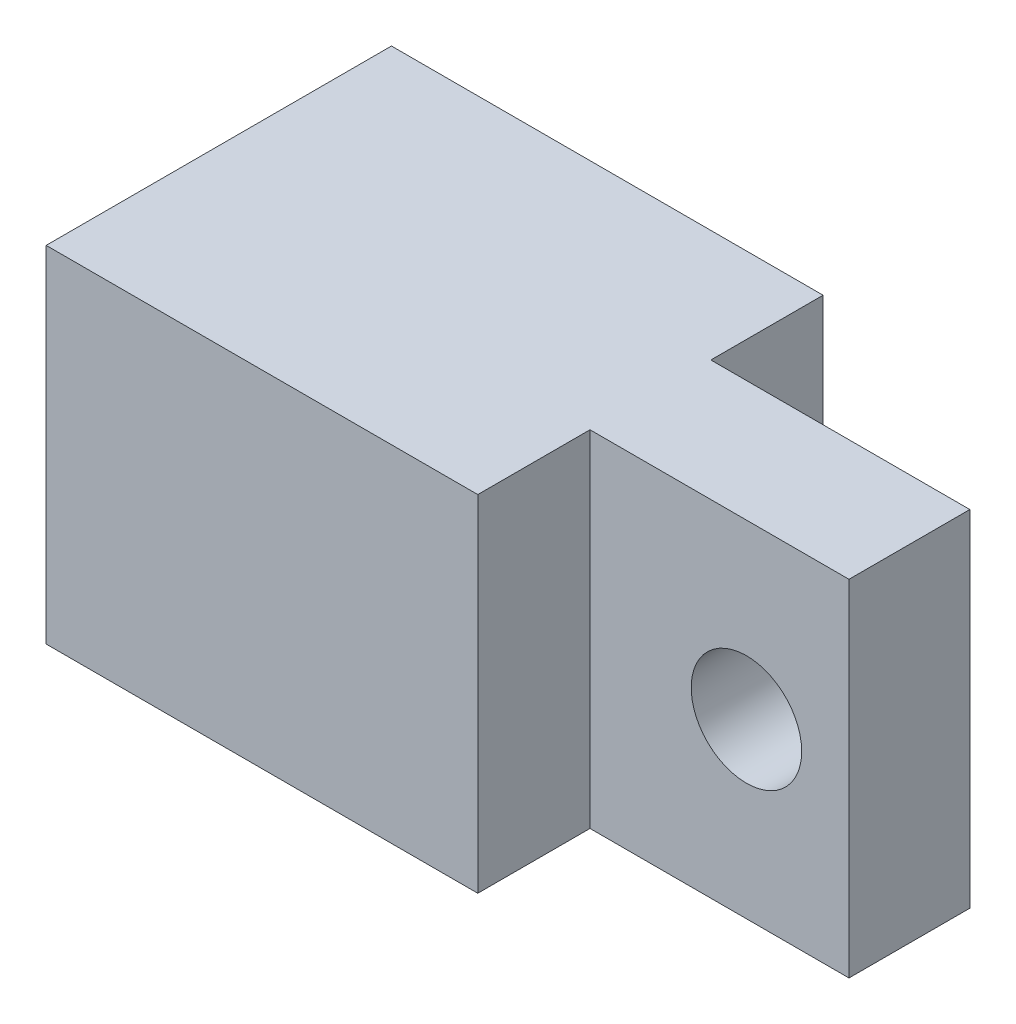
ISO-10303-21;
HEADER;
FILE_DESCRIPTION(('STEP AP214'),'2;1');
FILE_NAME('part.step','',(''),(''),'','','');
FILE_SCHEMA(('AUTOMOTIVE_DESIGN { 1 0 10303 214 1 1 1 1 }'));
ENDSEC;
DATA;
#1=APPLICATION_CONTEXT('core data for automotive mechanical design processes');
#2=APPLICATION_PROTOCOL_DEFINITION('international standard','automotive_design',2000,#1);
#3=PRODUCT_CONTEXT('',#1,'mechanical');
#4=PRODUCT('Part','Part','',(#3));
#5=PRODUCT_RELATED_PRODUCT_CATEGORY('part','',(#4));
#6=PRODUCT_DEFINITION_FORMATION('','',#4);
#7=PRODUCT_DEFINITION_CONTEXT('part definition',#1,'design');
#8=PRODUCT_DEFINITION('design','',#6,#7);
#9=PRODUCT_DEFINITION_SHAPE('','',#8);
#10=(LENGTH_UNIT() NAMED_UNIT(*) SI_UNIT(.MILLI.,.METRE.));
#11=(NAMED_UNIT(*) PLANE_ANGLE_UNIT() SI_UNIT($,.RADIAN.));
#12=(NAMED_UNIT(*) SI_UNIT($,.STERADIAN.) SOLID_ANGLE_UNIT());
#13=UNCERTAINTY_MEASURE_WITH_UNIT(LENGTH_MEASURE(1.E-05),#10,'distance_accuracy_value','');
#14=(GEOMETRIC_REPRESENTATION_CONTEXT(3) GLOBAL_UNCERTAINTY_ASSIGNED_CONTEXT((#13)) GLOBAL_UNIT_ASSIGNED_CONTEXT((#10,
#11,#12)) REPRESENTATION_CONTEXT('',''));
#15=CARTESIAN_POINT('',(0.,0.,0.));
#16=DIRECTION('',(0.,0.,1.));
#17=DIRECTION('',(1.,0.,0.));
#18=AXIS2_PLACEMENT_3D('',#15,#16,#17);
#19=CARTESIAN_POINT('',(6.25,10.,0.));
#20=DIRECTION('',(1.,0.,0.));
#21=DIRECTION('',(0.,0.,-1.));
#22=AXIS2_PLACEMENT_3D('',#19,#20,#21);
#23=PLANE('',#22);
#24=DIRECTION('',(0.,0.,1.));
#25=VECTOR('',#24,1.);
#26=CARTESIAN_POINT('',(6.25,0.,0.));
#27=LINE('',#26,#25);
#28=CARTESIAN_POINT('',(6.25,0.,1.75));
#29=VERTEX_POINT('',#28);
#30=CARTESIAN_POINT('',(6.25,0.,5.));
#31=VERTEX_POINT('',#30);
#32=EDGE_CURVE('E132',#29,#31,#27,.T.);
#33=ORIENTED_EDGE('',*,*,#32,.F.);
#34=DIRECTION('',(0.,-1.,0.));
#35=VECTOR('',#34,1.);
#36=CARTESIAN_POINT('',(6.25,10.,1.75));
#37=LINE('',#36,#35);
#38=CARTESIAN_POINT('',(6.25,10.,1.75));
#39=VERTEX_POINT('',#38);
#40=EDGE_CURVE('E11',#39,#29,#37,.T.);
#41=ORIENTED_EDGE('',*,*,#40,.F.);
#42=DIRECTION('',(0.,0.,1.));
#43=VECTOR('',#42,1.);
#44=CARTESIAN_POINT('',(6.25,10.,0.));
#45=LINE('',#44,#43);
#46=CARTESIAN_POINT('',(6.25,10.,5.));
#47=VERTEX_POINT('',#46);
#48=EDGE_CURVE('E151',#39,#47,#45,.T.);
#49=ORIENTED_EDGE('',*,*,#48,.T.);
#50=DIRECTION('',(0.,-1.,0.));
#51=VECTOR('',#50,1.);
#52=CARTESIAN_POINT('',(6.25,10.,5.));
#53=LINE('',#52,#51);
#54=EDGE_CURVE('E54',#47,#31,#53,.T.);
#55=ORIENTED_EDGE('',*,*,#54,.T.);
#56=EDGE_LOOP('',(#33,#41,#49,#55));
#57=FACE_BOUND('',#56,.T.);
#58=ADVANCED_FACE('F37',(#57),#23,.T.);
#59=CARTESIAN_POINT('',(0.,10.,1.75));
#60=DIRECTION('',(0.,0.,-1.));
#61=DIRECTION('',(-1.,0.,0.));
#62=AXIS2_PLACEMENT_3D('',#59,#60,#61);
#63=PLANE('',#62);
#64=CARTESIAN_POINT('',(10.7802630856264,5.,1.75));
#65=DIRECTION('',(0.,0.,1.));
#66=DIRECTION('',(1.,0.,0.));
#67=AXIS2_PLACEMENT_3D('',#64,#65,#66);
#68=CIRCLE('',#67,1.6);
#69=CARTESIAN_POINT('',(12.3802630856264,5.,1.75));
#70=VERTEX_POINT('',#69);
#71=EDGE_CURVE('E183',#70,#70,#68,.T.);
#72=ORIENTED_EDGE('',*,*,#71,.F.);
#73=EDGE_LOOP('',(#72));
#74=FACE_BOUND('',#73,.T.);
#75=DIRECTION('',(1.,0.,0.));
#76=VECTOR('',#75,1.);
#77=CARTESIAN_POINT('',(0.,0.,1.75));
#78=LINE('',#77,#76);
#79=CARTESIAN_POINT('',(13.75,0.,1.75));
#80=VERTEX_POINT('',#79);
#81=EDGE_CURVE('E134',#29,#80,#78,.T.);
#82=ORIENTED_EDGE('',*,*,#81,.T.);
#83=DIRECTION('',(0.,-1.,0.));
#84=VECTOR('',#83,1.);
#85=CARTESIAN_POINT('',(13.75,10.,1.75));
#86=LINE('',#85,#84);
#87=CARTESIAN_POINT('',(13.75,10.,1.75));
#88=VERTEX_POINT('',#87);
#89=EDGE_CURVE('E46',#88,#80,#86,.T.);
#90=ORIENTED_EDGE('',*,*,#89,.F.);
#91=DIRECTION('',(1.,0.,0.));
#92=VECTOR('',#91,1.);
#93=CARTESIAN_POINT('',(0.,10.,1.75));
#94=LINE('',#93,#92);
#95=EDGE_CURVE('E178',#39,#88,#94,.T.);
#96=ORIENTED_EDGE('',*,*,#95,.F.);
#97=ORIENTED_EDGE('',*,*,#40,.T.);
#98=EDGE_LOOP('',(#82,#90,#96,#97));
#99=FACE_BOUND('',#98,.T.);
#100=ADVANCED_FACE('F203',(#74,#99),#63,.F.);
#101=CARTESIAN_POINT('',(13.75,10.,0.));
#102=DIRECTION('',(-1.,0.,0.));
#103=DIRECTION('',(0.,0.,1.));
#104=AXIS2_PLACEMENT_3D('',#101,#102,#103);
#105=PLANE('',#104);
#106=DIRECTION('',(0.,0.,-1.));
#107=VECTOR('',#106,1.);
#108=CARTESIAN_POINT('',(13.75,0.,0.));
#109=LINE('',#108,#107);
#110=CARTESIAN_POINT('',(13.75,0.,-1.75));
#111=VERTEX_POINT('',#110);
#112=EDGE_CURVE('E136',#80,#111,#109,.T.);
#113=ORIENTED_EDGE('',*,*,#112,.T.);
#114=DIRECTION('',(0.,-1.,0.));
#115=VECTOR('',#114,1.);
#116=CARTESIAN_POINT('',(13.75,10.,-1.75));
#117=LINE('',#116,#115);
#118=CARTESIAN_POINT('',(13.75,10.,-1.75));
#119=VERTEX_POINT('',#118);
#120=EDGE_CURVE('E157',#119,#111,#117,.T.);
#121=ORIENTED_EDGE('',*,*,#120,.F.);
#122=DIRECTION('',(0.,0.,-1.));
#123=VECTOR('',#122,1.);
#124=CARTESIAN_POINT('',(13.75,10.,0.));
#125=LINE('',#124,#123);
#126=EDGE_CURVE('E166',#88,#119,#125,.T.);
#127=ORIENTED_EDGE('',*,*,#126,.F.);
#128=ORIENTED_EDGE('',*,*,#89,.T.);
#129=EDGE_LOOP('',(#113,#121,#127,#128));
#130=FACE_BOUND('',#129,.T.);
#131=ADVANCED_FACE('F164',(#130),#105,.F.);
#132=CARTESIAN_POINT('',(0.,10.,-1.75));
#133=DIRECTION('',(0.,0.,-1.));
#134=DIRECTION('',(-1.,0.,0.));
#135=AXIS2_PLACEMENT_3D('',#132,#133,#134);
#136=PLANE('',#135);
#137=CARTESIAN_POINT('',(10.7802630856264,5.,-1.75));
#138=DIRECTION('',(0.,0.,-1.));
#139=DIRECTION('',(-1.,0.,0.));
#140=AXIS2_PLACEMENT_3D('',#137,#138,#139);
#141=CIRCLE('',#140,1.6);
#142=CARTESIAN_POINT('',(9.1802630856264,5.,-1.75));
#143=VERTEX_POINT('',#142);
#144=EDGE_CURVE('E40',#143,#143,#141,.T.);
#145=ORIENTED_EDGE('',*,*,#144,.F.);
#146=EDGE_LOOP('',(#145));
#147=FACE_BOUND('',#146,.T.);
#148=DIRECTION('',(1.,0.,0.));
#149=VECTOR('',#148,1.);
#150=CARTESIAN_POINT('',(0.,0.,-1.75));
#151=LINE('',#150,#149);
#152=CARTESIAN_POINT('',(6.25,0.,-1.75));
#153=VERTEX_POINT('',#152);
#154=EDGE_CURVE('E139',#153,#111,#151,.T.);
#155=ORIENTED_EDGE('',*,*,#154,.F.);
#156=DIRECTION('',(0.,-1.,0.));
#157=VECTOR('',#156,1.);
#158=CARTESIAN_POINT('',(6.25,10.,-1.75));
#159=LINE('',#158,#157);
#160=CARTESIAN_POINT('',(6.25,10.,-1.75));
#161=VERTEX_POINT('',#160);
#162=EDGE_CURVE('E155',#161,#153,#159,.T.);
#163=ORIENTED_EDGE('',*,*,#162,.F.);
#164=DIRECTION('',(1.,0.,0.));
#165=VECTOR('',#164,1.);
#166=CARTESIAN_POINT('',(0.,10.,-1.75));
#167=LINE('',#166,#165);
#168=EDGE_CURVE('E176',#161,#119,#167,.T.);
#169=ORIENTED_EDGE('',*,*,#168,.T.);
#170=ORIENTED_EDGE('',*,*,#120,.T.);
#171=EDGE_LOOP('',(#155,#163,#169,#170));
#172=FACE_BOUND('',#171,.T.);
#173=ADVANCED_FACE('F174',(#147,#172),#136,.T.);
#174=CARTESIAN_POINT('',(6.25,10.,0.));
#175=DIRECTION('',(1.,0.,0.));
#176=DIRECTION('',(0.,0.,-1.));
#177=AXIS2_PLACEMENT_3D('',#174,#175,#176);
#178=PLANE('',#177);
#179=DIRECTION('',(0.,0.,1.));
#180=VECTOR('',#179,1.);
#181=CARTESIAN_POINT('',(6.25,0.,0.));
#182=LINE('',#181,#180);
#183=CARTESIAN_POINT('',(6.25,0.,-5.));
#184=VERTEX_POINT('',#183);
#185=EDGE_CURVE('E142',#184,#153,#182,.T.);
#186=ORIENTED_EDGE('',*,*,#185,.F.);
#187=DIRECTION('',(0.,-1.,0.));
#188=VECTOR('',#187,1.);
#189=CARTESIAN_POINT('',(6.25,10.,-5.));
#190=LINE('',#189,#188);
#191=CARTESIAN_POINT('',(6.25,10.,-5.));
#192=VERTEX_POINT('',#191);
#193=EDGE_CURVE('E124',#192,#184,#190,.T.);
#194=ORIENTED_EDGE('',*,*,#193,.F.);
#195=DIRECTION('',(0.,0.,1.));
#196=VECTOR('',#195,1.);
#197=CARTESIAN_POINT('',(6.25,10.,0.));
#198=LINE('',#197,#196);
#199=EDGE_CURVE('E114',#192,#161,#198,.T.);
#200=ORIENTED_EDGE('',*,*,#199,.T.);
#201=ORIENTED_EDGE('',*,*,#162,.T.);
#202=EDGE_LOOP('',(#186,#194,#200,#201));
#203=FACE_BOUND('',#202,.T.);
#204=ADVANCED_FACE('F193',(#203),#178,.T.);
#205=CARTESIAN_POINT('',(0.,10.,-5.));
#206=DIRECTION('',(0.,0.,1.));
#207=DIRECTION('',(1.,0.,0.));
#208=AXIS2_PLACEMENT_3D('',#205,#206,#207);
#209=PLANE('',#208);
#210=DIRECTION('',(-1.,0.,0.));
#211=VECTOR('',#210,1.);
#212=CARTESIAN_POINT('',(0.,0.,-5.));
#213=LINE('',#212,#211);
#214=CARTESIAN_POINT('',(-6.25,0.,-5.));
#215=VERTEX_POINT('',#214);
#216=EDGE_CURVE('E121',#184,#215,#213,.T.);
#217=ORIENTED_EDGE('',*,*,#216,.T.);
#218=DIRECTION('',(0.,-1.,0.));
#219=VECTOR('',#218,1.);
#220=CARTESIAN_POINT('',(-6.25,10.,-5.));
#221=LINE('',#220,#219);
#222=CARTESIAN_POINT('',(-6.25,10.,-5.));
#223=VERTEX_POINT('',#222);
#224=EDGE_CURVE('E118',#223,#215,#221,.T.);
#225=ORIENTED_EDGE('',*,*,#224,.F.);
#226=DIRECTION('',(-1.,0.,0.));
#227=VECTOR('',#226,1.);
#228=CARTESIAN_POINT('',(0.,10.,-5.));
#229=LINE('',#228,#227);
#230=EDGE_CURVE('E105',#192,#223,#229,.T.);
#231=ORIENTED_EDGE('',*,*,#230,.F.);
#232=ORIENTED_EDGE('',*,*,#193,.T.);
#233=EDGE_LOOP('',(#217,#225,#231,#232));
#234=FACE_BOUND('',#233,.T.);
#235=ADVANCED_FACE('F119',(#234),#209,.F.);
#236=CARTESIAN_POINT('',(-6.25,10.,0.));
#237=DIRECTION('',(-1.,0.,0.));
#238=DIRECTION('',(0.,0.,1.));
#239=AXIS2_PLACEMENT_3D('',#236,#237,#238);
#240=PLANE('',#239);
#241=DIRECTION('',(0.,0.,-1.));
#242=VECTOR('',#241,1.);
#243=CARTESIAN_POINT('',(-6.25,0.,0.));
#244=LINE('',#243,#242);
#245=CARTESIAN_POINT('',(-6.25,0.,5.));
#246=VERTEX_POINT('',#245);
#247=EDGE_CURVE('E146',#246,#215,#244,.T.);
#248=ORIENTED_EDGE('',*,*,#247,.F.);
#249=DIRECTION('',(0.,-1.,0.));
#250=VECTOR('',#249,1.);
#251=CARTESIAN_POINT('',(-6.25,10.,5.));
#252=LINE('',#251,#250);
#253=CARTESIAN_POINT('',(-6.25,10.,5.));
#254=VERTEX_POINT('',#253);
#255=EDGE_CURVE('E79',#254,#246,#252,.T.);
#256=ORIENTED_EDGE('',*,*,#255,.F.);
#257=DIRECTION('',(0.,0.,-1.));
#258=VECTOR('',#257,1.);
#259=CARTESIAN_POINT('',(-6.25,10.,0.));
#260=LINE('',#259,#258);
#261=EDGE_CURVE('E111',#254,#223,#260,.T.);
#262=ORIENTED_EDGE('',*,*,#261,.T.);
#263=ORIENTED_EDGE('',*,*,#224,.T.);
#264=EDGE_LOOP('',(#248,#256,#262,#263));
#265=FACE_BOUND('',#264,.T.);
#266=ADVANCED_FACE('F126',(#265),#240,.T.);
#267=CARTESIAN_POINT('',(0.,10.,5.));
#268=DIRECTION('',(0.,0.,1.));
#269=DIRECTION('',(1.,0.,0.));
#270=AXIS2_PLACEMENT_3D('',#267,#268,#269);
#271=PLANE('',#270);
#272=DIRECTION('',(-1.,0.,0.));
#273=VECTOR('',#272,1.);
#274=CARTESIAN_POINT('',(0.,0.,5.));
#275=LINE('',#274,#273);
#276=EDGE_CURVE('E148',#31,#246,#275,.T.);
#277=ORIENTED_EDGE('',*,*,#276,.F.);
#278=ORIENTED_EDGE('',*,*,#54,.F.);
#279=DIRECTION('',(-1.,0.,0.));
#280=VECTOR('',#279,1.);
#281=CARTESIAN_POINT('',(0.,10.,5.));
#282=LINE('',#281,#280);
#283=EDGE_CURVE('E127',#47,#254,#282,.T.);
#284=ORIENTED_EDGE('',*,*,#283,.T.);
#285=ORIENTED_EDGE('',*,*,#255,.T.);
#286=EDGE_LOOP('',(#277,#278,#284,#285));
#287=FACE_BOUND('',#286,.T.);
#288=ADVANCED_FACE('F210',(#287),#271,.T.);
#289=CARTESIAN_POINT('',(0.,10.,0.));
#290=DIRECTION('',(0.,1.,0.));
#291=DIRECTION('',(0.,0.,1.));
#292=AXIS2_PLACEMENT_3D('',#289,#290,#291);
#293=PLANE('',#292);
#294=ORIENTED_EDGE('',*,*,#48,.F.);
#295=ORIENTED_EDGE('',*,*,#95,.T.);
#296=ORIENTED_EDGE('',*,*,#126,.T.);
#297=ORIENTED_EDGE('',*,*,#168,.F.);
#298=ORIENTED_EDGE('',*,*,#199,.F.);
#299=ORIENTED_EDGE('',*,*,#230,.T.);
#300=ORIENTED_EDGE('',*,*,#261,.F.);
#301=ORIENTED_EDGE('',*,*,#283,.F.);
#302=EDGE_LOOP('',(#294,#295,#296,#297,#298,#299,#300,#301));
#303=FACE_BOUND('',#302,.T.);
#304=ADVANCED_FACE('F108',(#303),#293,.T.);
#305=CARTESIAN_POINT('',(0.,0.,0.));
#306=DIRECTION('',(0.,1.,0.));
#307=DIRECTION('',(0.,0.,1.));
#308=AXIS2_PLACEMENT_3D('',#305,#306,#307);
#309=PLANE('',#308);
#310=ORIENTED_EDGE('',*,*,#32,.T.);
#311=ORIENTED_EDGE('',*,*,#276,.T.);
#312=ORIENTED_EDGE('',*,*,#247,.T.);
#313=ORIENTED_EDGE('',*,*,#216,.F.);
#314=ORIENTED_EDGE('',*,*,#185,.T.);
#315=ORIENTED_EDGE('',*,*,#154,.T.);
#316=ORIENTED_EDGE('',*,*,#112,.F.);
#317=ORIENTED_EDGE('',*,*,#81,.F.);
#318=EDGE_LOOP('',(#310,#311,#312,#313,#314,#315,#316,#317));
#319=FACE_BOUND('',#318,.T.);
#320=ADVANCED_FACE('F170',(#319),#309,.F.);
#321=CARTESIAN_POINT('',(10.7802630856264,5.,-5.));
#322=DIRECTION('',(0.,0.,1.));
#323=DIRECTION('',(1.,0.,0.));
#324=AXIS2_PLACEMENT_3D('',#321,#322,#323);
#325=CYLINDRICAL_SURFACE('',#324,1.6);
#326=ORIENTED_EDGE('',*,*,#144,.T.);
#327=EDGE_LOOP('',(#326));
#328=FACE_BOUND('',#327,.T.);
#329=ORIENTED_EDGE('',*,*,#71,.T.);
#330=EDGE_LOOP('',(#329));
#331=FACE_BOUND('',#330,.T.);
#332=ADVANCED_FACE('F190',(#328,#331),#325,.F.);
#333=CLOSED_SHELL('',(#58,#100,#131,#173,#204,#235,#266,#288,#304,#320,#332));
#334=MANIFOLD_SOLID_BREP('B2',#333);
#335=ADVANCED_BREP_SHAPE_REPRESENTATION('',(#18,#334),#14);
#336=SHAPE_DEFINITION_REPRESENTATION(#9,#335);
ENDSEC;
END-ISO-10303-21;
